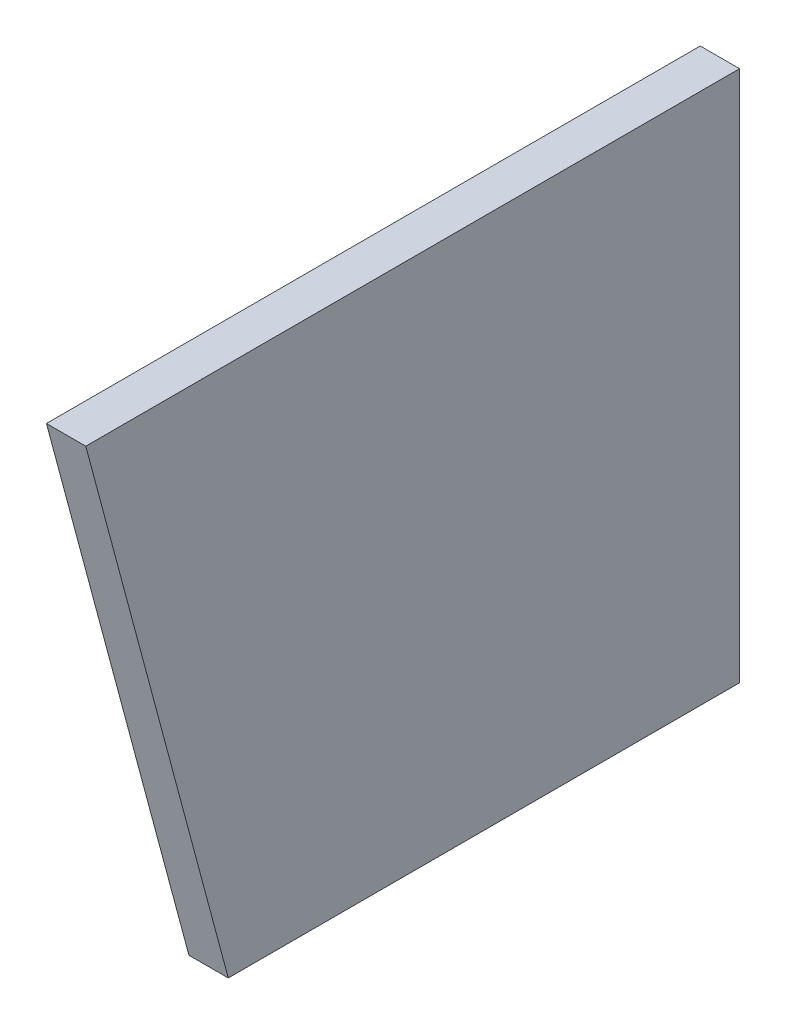
ISO-10303-21;
HEADER;
FILE_DESCRIPTION(('STEP AP214'),'2;1');
FILE_NAME('part.step','',(''),(''),'','','');
FILE_SCHEMA(('AUTOMOTIVE_DESIGN { 1 0 10303 214 1 1 1 1 }'));
ENDSEC;
DATA;
#1=APPLICATION_CONTEXT('core data for automotive mechanical design processes');
#2=APPLICATION_PROTOCOL_DEFINITION('international standard','automotive_design',2000,#1);
#3=PRODUCT_CONTEXT('',#1,'mechanical');
#4=PRODUCT('Part','Part','',(#3));
#5=PRODUCT_RELATED_PRODUCT_CATEGORY('part','',(#4));
#6=PRODUCT_DEFINITION_FORMATION('','',#4);
#7=PRODUCT_DEFINITION_CONTEXT('part definition',#1,'design');
#8=PRODUCT_DEFINITION('design','',#6,#7);
#9=PRODUCT_DEFINITION_SHAPE('','',#8);
#10=(LENGTH_UNIT() NAMED_UNIT(*) SI_UNIT(.MILLI.,.METRE.));
#11=(NAMED_UNIT(*) PLANE_ANGLE_UNIT() SI_UNIT($,.RADIAN.));
#12=(NAMED_UNIT(*) SI_UNIT($,.STERADIAN.) SOLID_ANGLE_UNIT());
#13=UNCERTAINTY_MEASURE_WITH_UNIT(LENGTH_MEASURE(1.E-05),#10,'distance_accuracy_value','');
#14=(GEOMETRIC_REPRESENTATION_CONTEXT(3) GLOBAL_UNCERTAINTY_ASSIGNED_CONTEXT((#13)) GLOBAL_UNIT_ASSIGNED_CONTEXT((#10,
#11,#12)) REPRESENTATION_CONTEXT('',''));
#15=CARTESIAN_POINT('',(0.,0.,0.));
#16=DIRECTION('',(0.,0.,1.));
#17=DIRECTION('',(1.,0.,0.));
#18=AXIS2_PLACEMENT_3D('',#15,#16,#17);
#19=CARTESIAN_POINT('',(-12.7000000000013,171.7294,381.));
#20=DIRECTION('',(1.,0.,0.));
#21=DIRECTION('',(0.,1.,0.));
#22=AXIS2_PLACEMENT_3D('',#19,#20,#21);
#23=PLANE('',#22);
#24=DIRECTION('',(0.,0.,-1.));
#25=VECTOR('',#24,1.);
#26=CARTESIAN_POINT('',(-12.7,0.,381.));
#27=LINE('',#26,#25);
#28=CARTESIAN_POINT('',(-12.7000000000013,0.,165.1));
#29=VERTEX_POINT('',#28);
#30=CARTESIAN_POINT('',(-12.7,0.,0.));
#31=VERTEX_POINT('',#30);
#32=EDGE_CURVE('E11',#29,#31,#27,.T.);
#33=ORIENTED_EDGE('',*,*,#32,.F.);
#34=DIRECTION('',(0.,0.965925826289068,0.258819045102522));
#35=VECTOR('',#34,1.);
#36=CARTESIAN_POINT('',(-12.7000000000013,0.,165.1));
#37=LINE('',#36,#35);
#38=CARTESIAN_POINT('',(-12.7000000000025,171.7294,211.114754046681));
#39=VERTEX_POINT('',#38);
#40=EDGE_CURVE('E78',#29,#39,#37,.T.);
#41=ORIENTED_EDGE('',*,*,#40,.T.);
#42=DIRECTION('',(0.,0.,-1.));
#43=VECTOR('',#42,1.);
#44=CARTESIAN_POINT('',(-12.7000000000013,171.7294,381.));
#45=LINE('',#44,#43);
#46=CARTESIAN_POINT('',(-12.7000000000013,171.7294,0.));
#47=VERTEX_POINT('',#46);
#48=EDGE_CURVE('E62',#39,#47,#45,.T.);
#49=ORIENTED_EDGE('',*,*,#48,.T.);
#50=DIRECTION('',(0.,-1.,0.));
#51=VECTOR('',#50,1.);
#52=CARTESIAN_POINT('',(-12.7000000000013,171.7294,0.));
#53=LINE('',#52,#51);
#54=EDGE_CURVE('E94',#47,#31,#53,.T.);
#55=ORIENTED_EDGE('',*,*,#54,.T.);
#56=EDGE_LOOP('',(#33,#41,#49,#55));
#57=FACE_BOUND('',#56,.T.);
#58=ADVANCED_FACE('F39',(#57),#23,.F.);
#59=CARTESIAN_POINT('',(-12.7,0.,381.));
#60=DIRECTION('',(0.,1.,0.));
#61=DIRECTION('',(0.,0.,1.));
#62=AXIS2_PLACEMENT_3D('',#59,#60,#61);
#63=PLANE('',#62);
#64=DIRECTION('',(0.,0.,-1.));
#65=VECTOR('',#64,1.);
#66=CARTESIAN_POINT('',(0.,0.,381.));
#67=LINE('',#66,#65);
#68=CARTESIAN_POINT('',(0.,0.,165.1));
#69=VERTEX_POINT('',#68);
#70=CARTESIAN_POINT('',(0.,0.,0.));
#71=VERTEX_POINT('',#70);
#72=EDGE_CURVE('E47',#69,#71,#67,.T.);
#73=ORIENTED_EDGE('',*,*,#72,.F.);
#74=DIRECTION('',(1.,0.,0.));
#75=VECTOR('',#74,1.);
#76=CARTESIAN_POINT('',(-12.7000000000013,0.,165.1));
#77=LINE('',#76,#75);
#78=EDGE_CURVE('E81',#29,#69,#77,.T.);
#79=ORIENTED_EDGE('',*,*,#78,.F.);
#80=ORIENTED_EDGE('',*,*,#32,.T.);
#81=DIRECTION('',(1.,0.,0.));
#82=VECTOR('',#81,1.);
#83=CARTESIAN_POINT('',(-12.7,0.,0.));
#84=LINE('',#83,#82);
#85=EDGE_CURVE('E98',#31,#71,#84,.T.);
#86=ORIENTED_EDGE('',*,*,#85,.T.);
#87=EDGE_LOOP('',(#73,#79,#80,#86));
#88=FACE_BOUND('',#87,.T.);
#89=ADVANCED_FACE('F88',(#88),#63,.F.);
#90=CARTESIAN_POINT('',(0.,0.,381.));
#91=DIRECTION('',(-1.,0.,0.));
#92=DIRECTION('',(0.,-1.,0.));
#93=AXIS2_PLACEMENT_3D('',#90,#91,#92);
#94=PLANE('',#93);
#95=DIRECTION('',(0.,0.,-1.));
#96=VECTOR('',#95,1.);
#97=CARTESIAN_POINT('',(-1.2622723488703E-12,171.7294,381.));
#98=LINE('',#97,#96);
#99=CARTESIAN_POINT('',(-1.2622723488703E-12,171.7294,211.114754046681));
#100=VERTEX_POINT('',#99);
#101=CARTESIAN_POINT('',(-1.2622723488703E-12,171.7294,0.));
#102=VERTEX_POINT('',#101);
#103=EDGE_CURVE('E114',#100,#102,#98,.T.);
#104=ORIENTED_EDGE('',*,*,#103,.F.);
#105=DIRECTION('',(0.,0.965925826289068,0.258819045102522));
#106=VECTOR('',#105,1.);
#107=CARTESIAN_POINT('',(0.,0.,165.1));
#108=LINE('',#107,#106);
#109=EDGE_CURVE('E54',#69,#100,#108,.T.);
#110=ORIENTED_EDGE('',*,*,#109,.F.);
#111=ORIENTED_EDGE('',*,*,#72,.T.);
#112=DIRECTION('',(0.,1.,0.));
#113=VECTOR('',#112,1.);
#114=CARTESIAN_POINT('',(0.,0.,0.));
#115=LINE('',#114,#113);
#116=EDGE_CURVE('E102',#71,#102,#115,.T.);
#117=ORIENTED_EDGE('',*,*,#116,.T.);
#118=EDGE_LOOP('',(#104,#110,#111,#117));
#119=FACE_BOUND('',#118,.T.);
#120=ADVANCED_FACE('F119',(#119),#94,.F.);
#121=CARTESIAN_POINT('',(-1.2622723488703E-12,171.7294,381.));
#122=DIRECTION('',(0.,-1.,0.));
#123=DIRECTION('',(0.,0.,-1.));
#124=AXIS2_PLACEMENT_3D('',#121,#122,#123);
#125=PLANE('',#124);
#126=ORIENTED_EDGE('',*,*,#48,.F.);
#127=DIRECTION('',(1.,0.,0.));
#128=VECTOR('',#127,1.);
#129=CARTESIAN_POINT('',(-12.7000000000025,171.7294,211.114754046681));
#130=LINE('',#129,#128);
#131=EDGE_CURVE('E82',#39,#100,#130,.T.);
#132=ORIENTED_EDGE('',*,*,#131,.T.);
#133=ORIENTED_EDGE('',*,*,#103,.T.);
#134=DIRECTION('',(-1.,0.,0.));
#135=VECTOR('',#134,1.);
#136=CARTESIAN_POINT('',(-1.2622723488703E-12,171.7294,0.));
#137=LINE('',#136,#135);
#138=EDGE_CURVE('E109',#102,#47,#137,.T.);
#139=ORIENTED_EDGE('',*,*,#138,.T.);
#140=EDGE_LOOP('',(#126,#132,#133,#139));
#141=FACE_BOUND('',#140,.T.);
#142=ADVANCED_FACE('F123',(#141),#125,.F.);
#143=CARTESIAN_POINT('',(0.,0.,0.));
#144=DIRECTION('',(0.,0.,1.));
#145=DIRECTION('',(1.,0.,0.));
#146=AXIS2_PLACEMENT_3D('',#143,#144,#145);
#147=PLANE('',#146);
#148=ORIENTED_EDGE('',*,*,#54,.F.);
#149=ORIENTED_EDGE('',*,*,#138,.F.);
#150=ORIENTED_EDGE('',*,*,#116,.F.);
#151=ORIENTED_EDGE('',*,*,#85,.F.);
#152=EDGE_LOOP('',(#148,#149,#150,#151));
#153=FACE_BOUND('',#152,.T.);
#154=ADVANCED_FACE('F121',(#153),#147,.F.);
#155=CARTESIAN_POINT('',(-12.7000000000013,0.,165.1));
#156=DIRECTION('',(0.,0.258819045102522,-0.965925826289068));
#157=DIRECTION('',(0.,0.965925826289068,0.258819045102522));
#158=AXIS2_PLACEMENT_3D('',#155,#156,#157);
#159=PLANE('',#158);
#160=ORIENTED_EDGE('',*,*,#109,.T.);
#161=ORIENTED_EDGE('',*,*,#131,.F.);
#162=ORIENTED_EDGE('',*,*,#40,.F.);
#163=ORIENTED_EDGE('',*,*,#78,.T.);
#164=EDGE_LOOP('',(#160,#161,#162,#163));
#165=FACE_BOUND('',#164,.T.);
#166=ADVANCED_FACE('F80',(#165),#159,.F.);
#167=CLOSED_SHELL('',(#58,#89,#120,#142,#154,#166));
#168=MANIFOLD_SOLID_BREP('B2',#167);
#169=ADVANCED_BREP_SHAPE_REPRESENTATION('',(#18,#168),#14);
#170=SHAPE_DEFINITION_REPRESENTATION(#9,#169);
ENDSEC;
END-ISO-10303-21;
